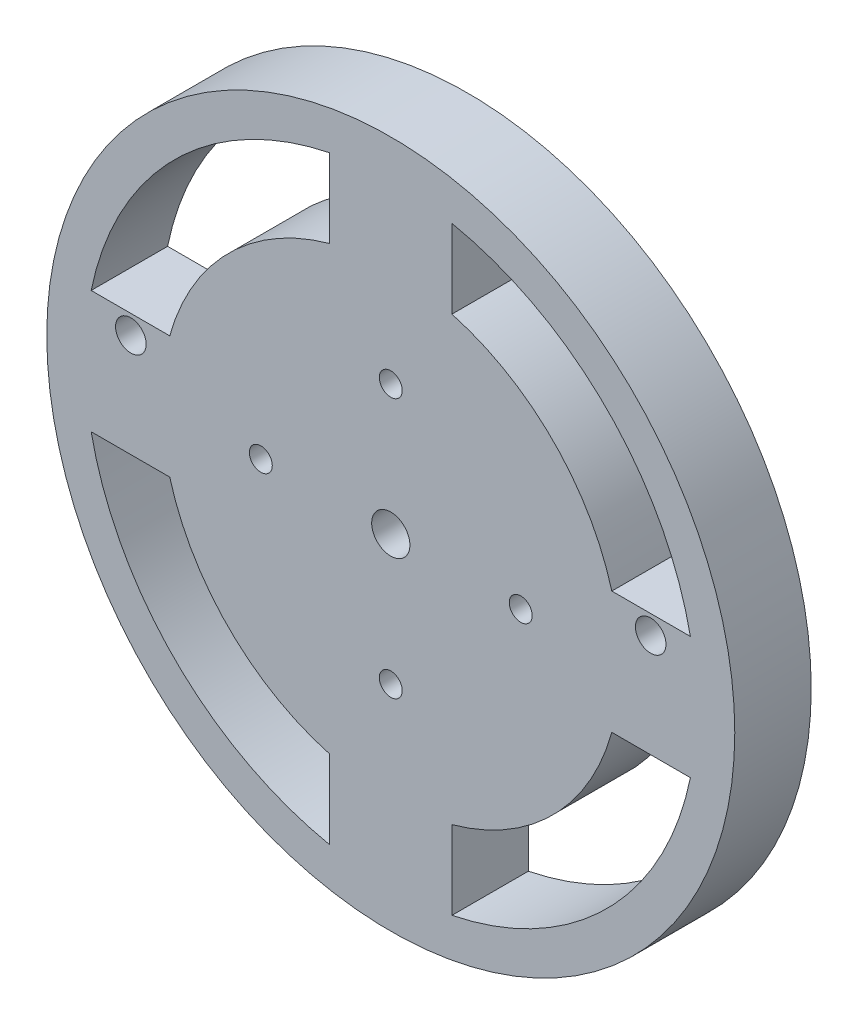
ISO-10303-21;
HEADER;
FILE_DESCRIPTION(('STEP AP214'),'2;1');
FILE_NAME('part.step','',(''),(''),'','','');
FILE_SCHEMA(('AUTOMOTIVE_DESIGN { 1 0 10303 214 1 1 1 1 }'));
ENDSEC;
DATA;
#1=APPLICATION_CONTEXT('core data for automotive mechanical design processes');
#2=APPLICATION_PROTOCOL_DEFINITION('international standard','automotive_design',2000,#1);
#3=PRODUCT_CONTEXT('',#1,'mechanical');
#4=PRODUCT('Part','Part','',(#3));
#5=PRODUCT_RELATED_PRODUCT_CATEGORY('part','',(#4));
#6=PRODUCT_DEFINITION_FORMATION('','',#4);
#7=PRODUCT_DEFINITION_CONTEXT('part definition',#1,'design');
#8=PRODUCT_DEFINITION('design','',#6,#7);
#9=PRODUCT_DEFINITION_SHAPE('','',#8);
#10=(LENGTH_UNIT() NAMED_UNIT(*) SI_UNIT(.MILLI.,.METRE.));
#11=(NAMED_UNIT(*) PLANE_ANGLE_UNIT() SI_UNIT($,.RADIAN.));
#12=(NAMED_UNIT(*) SI_UNIT($,.STERADIAN.) SOLID_ANGLE_UNIT());
#13=UNCERTAINTY_MEASURE_WITH_UNIT(LENGTH_MEASURE(1.E-05),#10,'distance_accuracy_value','');
#14=(GEOMETRIC_REPRESENTATION_CONTEXT(3) GLOBAL_UNCERTAINTY_ASSIGNED_CONTEXT((#13)) GLOBAL_UNIT_ASSIGNED_CONTEXT((#10,
#11,#12)) REPRESENTATION_CONTEXT('',''));
#15=CARTESIAN_POINT('',(0.,0.,0.));
#16=DIRECTION('',(0.,0.,1.));
#17=DIRECTION('',(1.,0.,0.));
#18=AXIS2_PLACEMENT_3D('',#15,#16,#17);
#19=CARTESIAN_POINT('',(0.,0.,10.));
#20=DIRECTION('',(0.,0.,1.));
#21=DIRECTION('',(1.,0.,0.));
#22=AXIS2_PLACEMENT_3D('',#19,#20,#21);
#23=PLANE('',#22);
#24=CARTESIAN_POINT('',(34.,5.5,10.));
#25=DIRECTION('',(0.,0.,1.));
#26=DIRECTION('',(1.,0.,0.));
#27=AXIS2_PLACEMENT_3D('',#24,#25,#26);
#28=CIRCLE('',#27,2.);
#29=CARTESIAN_POINT('',(36.,5.5,10.));
#30=VERTEX_POINT('',#29);
#31=EDGE_CURVE('E334',#30,#30,#28,.T.);
#32=ORIENTED_EDGE('',*,*,#31,.F.);
#33=EDGE_LOOP('',(#32));
#34=FACE_BOUND('',#33,.T.);
#35=CARTESIAN_POINT('',(-34.,5.5,10.));
#36=DIRECTION('',(0.,0.,1.));
#37=DIRECTION('',(1.,0.,0.));
#38=AXIS2_PLACEMENT_3D('',#35,#36,#37);
#39=CIRCLE('',#38,2.);
#40=CARTESIAN_POINT('',(-32.,5.5,10.));
#41=VERTEX_POINT('',#40);
#42=EDGE_CURVE('E338',#41,#41,#39,.T.);
#43=ORIENTED_EDGE('',*,*,#42,.F.);
#44=EDGE_LOOP('',(#43));
#45=FACE_BOUND('',#44,.T.);
#46=CARTESIAN_POINT('',(0.,-17.,10.));
#47=DIRECTION('',(0.,0.,1.));
#48=DIRECTION('',(1.,0.,0.));
#49=AXIS2_PLACEMENT_3D('',#46,#47,#48);
#50=CIRCLE('',#49,1.5);
#51=CARTESIAN_POINT('',(1.50000000000001,-17.,10.));
#52=VERTEX_POINT('',#51);
#53=EDGE_CURVE('E283',#52,#52,#50,.T.);
#54=ORIENTED_EDGE('',*,*,#53,.F.);
#55=EDGE_LOOP('',(#54));
#56=FACE_BOUND('',#55,.T.);
#57=CARTESIAN_POINT('',(0.,17.,10.));
#58=DIRECTION('',(0.,0.,1.));
#59=DIRECTION('',(1.,0.,0.));
#60=AXIS2_PLACEMENT_3D('',#57,#58,#59);
#61=CIRCLE('',#60,1.5);
#62=CARTESIAN_POINT('',(1.50000000000001,17.,10.));
#63=VERTEX_POINT('',#62);
#64=EDGE_CURVE('E295',#63,#63,#61,.T.);
#65=ORIENTED_EDGE('',*,*,#64,.F.);
#66=EDGE_LOOP('',(#65));
#67=FACE_BOUND('',#66,.T.);
#68=CARTESIAN_POINT('',(0.,0.,10.));
#69=DIRECTION('',(0.,0.,1.));
#70=DIRECTION('',(1.,0.,0.));
#71=AXIS2_PLACEMENT_3D('',#68,#69,#70);
#72=CIRCLE('',#71,45.);
#73=CARTESIAN_POINT('',(45.,0.,10.));
#74=VERTEX_POINT('',#73);
#75=EDGE_CURVE('E11',#74,#74,#72,.T.);
#76=ORIENTED_EDGE('',*,*,#75,.T.);
#77=EDGE_LOOP('',(#76));
#78=FACE_BOUND('',#77,.T.);
#79=CARTESIAN_POINT('',(0.,0.,10.));
#80=DIRECTION('',(0.,0.,1.));
#81=DIRECTION('',(1.,0.,0.));
#82=AXIS2_PLACEMENT_3D('',#79,#80,#81);
#83=CIRCLE('',#82,2.5);
#84=CARTESIAN_POINT('',(2.5,0.,10.));
#85=VERTEX_POINT('',#84);
#86=EDGE_CURVE('E301',#85,#85,#83,.T.);
#87=ORIENTED_EDGE('',*,*,#86,.F.);
#88=EDGE_LOOP('',(#87));
#89=FACE_BOUND('',#88,.T.);
#90=CARTESIAN_POINT('',(17.,0.,10.));
#91=DIRECTION('',(0.,0.,1.));
#92=DIRECTION('',(1.,0.,0.));
#93=AXIS2_PLACEMENT_3D('',#90,#91,#92);
#94=CIRCLE('',#93,1.5);
#95=CARTESIAN_POINT('',(18.5,0.,10.));
#96=VERTEX_POINT('',#95);
#97=EDGE_CURVE('E289',#96,#96,#94,.T.);
#98=ORIENTED_EDGE('',*,*,#97,.F.);
#99=EDGE_LOOP('',(#98));
#100=FACE_BOUND('',#99,.T.);
#101=CARTESIAN_POINT('',(-17.,0.,10.));
#102=DIRECTION('',(0.,0.,1.));
#103=DIRECTION('',(1.,0.,0.));
#104=AXIS2_PLACEMENT_3D('',#101,#102,#103);
#105=CIRCLE('',#104,1.5);
#106=CARTESIAN_POINT('',(-15.5,0.,10.));
#107=VERTEX_POINT('',#106);
#108=EDGE_CURVE('E277',#107,#107,#105,.T.);
#109=ORIENTED_EDGE('',*,*,#108,.F.);
#110=EDGE_LOOP('',(#109));
#111=FACE_BOUND('',#110,.T.);
#112=DIRECTION('',(1.,0.,0.));
#113=VECTOR('',#112,1.);
#114=CARTESIAN_POINT('',(-39.1918358845309,8.,10.));
#115=LINE('',#114,#113);
#116=CARTESIAN_POINT('',(-39.1918358845309,8.,10.));
#117=VERTEX_POINT('',#116);
#118=CARTESIAN_POINT('',(-28.9136645896019,8.,10.));
#119=VERTEX_POINT('',#118);
#120=EDGE_CURVE('E248',#117,#119,#115,.T.);
#121=ORIENTED_EDGE('',*,*,#120,.F.);
#122=CARTESIAN_POINT('',(0.,0.,10.));
#123=DIRECTION('',(0.,0.,1.));
#124=DIRECTION('',(1.,0.,0.));
#125=AXIS2_PLACEMENT_3D('',#122,#123,#124);
#126=CIRCLE('',#125,40.);
#127=CARTESIAN_POINT('',(-8.,39.1918358845309,10.));
#128=VERTEX_POINT('',#127);
#129=EDGE_CURVE('E246',#128,#117,#126,.T.);
#130=ORIENTED_EDGE('',*,*,#129,.F.);
#131=DIRECTION('',(0.,1.,0.));
#132=VECTOR('',#131,1.);
#133=CARTESIAN_POINT('',(-8.,39.1918358845309,10.));
#134=LINE('',#133,#132);
#135=CARTESIAN_POINT('',(-8.,28.9136645896019,10.));
#136=VERTEX_POINT('',#135);
#137=EDGE_CURVE('E254',#136,#128,#134,.T.);
#138=ORIENTED_EDGE('',*,*,#137,.F.);
#139=CARTESIAN_POINT('',(0.,0.,10.));
#140=DIRECTION('',(0.,0.,-1.));
#141=DIRECTION('',(1.,0.,0.));
#142=AXIS2_PLACEMENT_3D('',#139,#140,#141);
#143=CIRCLE('',#142,30.);
#144=EDGE_CURVE('E251',#119,#136,#143,.T.);
#145=ORIENTED_EDGE('',*,*,#144,.F.);
#146=EDGE_LOOP('',(#121,#130,#138,#145));
#147=FACE_BOUND('',#146,.T.);
#148=DIRECTION('',(1.,0.,0.));
#149=VECTOR('',#148,1.);
#150=CARTESIAN_POINT('',(28.9136645896019,8.,10.));
#151=LINE('',#150,#149);
#152=CARTESIAN_POINT('',(28.9136645896019,8.,10.));
#153=VERTEX_POINT('',#152);
#154=CARTESIAN_POINT('',(39.1918358845309,8.,10.));
#155=VERTEX_POINT('',#154);
#156=EDGE_CURVE('E217',#153,#155,#151,.T.);
#157=ORIENTED_EDGE('',*,*,#156,.F.);
#158=CARTESIAN_POINT('',(0.,0.,10.));
#159=DIRECTION('',(0.,0.,-1.));
#160=DIRECTION('',(1.,0.,0.));
#161=AXIS2_PLACEMENT_3D('',#158,#159,#160);
#162=CIRCLE('',#161,30.);
#163=CARTESIAN_POINT('',(8.,28.9136645896019,10.));
#164=VERTEX_POINT('',#163);
#165=EDGE_CURVE('E215',#164,#153,#162,.T.);
#166=ORIENTED_EDGE('',*,*,#165,.F.);
#167=DIRECTION('',(0.,-1.,0.));
#168=VECTOR('',#167,1.);
#169=CARTESIAN_POINT('',(8.,39.1918358845309,10.));
#170=LINE('',#169,#168);
#171=CARTESIAN_POINT('',(8.,39.1918358845309,10.));
#172=VERTEX_POINT('',#171);
#173=EDGE_CURVE('E223',#172,#164,#170,.T.);
#174=ORIENTED_EDGE('',*,*,#173,.F.);
#175=CARTESIAN_POINT('',(0.,0.,10.));
#176=DIRECTION('',(0.,0.,1.));
#177=DIRECTION('',(1.,0.,0.));
#178=AXIS2_PLACEMENT_3D('',#175,#176,#177);
#179=CIRCLE('',#178,40.);
#180=EDGE_CURVE('E220',#155,#172,#179,.T.);
#181=ORIENTED_EDGE('',*,*,#180,.F.);
#182=EDGE_LOOP('',(#157,#166,#174,#181));
#183=FACE_BOUND('',#182,.T.);
#184=DIRECTION('',(0.,1.,0.));
#185=VECTOR('',#184,1.);
#186=CARTESIAN_POINT('',(-8.,-28.9136645896019,10.));
#187=LINE('',#186,#185);
#188=CARTESIAN_POINT('',(-8.,-39.1918358845308,10.));
#189=VERTEX_POINT('',#188);
#190=CARTESIAN_POINT('',(-8.00000000000001,-28.9136645896019,10.));
#191=VERTEX_POINT('',#190);
#192=EDGE_CURVE('E186',#189,#191,#187,.T.);
#193=ORIENTED_EDGE('',*,*,#192,.F.);
#194=CARTESIAN_POINT('',(0.,0.,10.));
#195=DIRECTION('',(0.,0.,1.));
#196=DIRECTION('',(1.,0.,0.));
#197=AXIS2_PLACEMENT_3D('',#194,#195,#196);
#198=CIRCLE('',#197,40.);
#199=CARTESIAN_POINT('',(-39.1918358845309,-8.,10.));
#200=VERTEX_POINT('',#199);
#201=EDGE_CURVE('E184',#200,#189,#198,.T.);
#202=ORIENTED_EDGE('',*,*,#201,.F.);
#203=DIRECTION('',(-1.,0.,0.));
#204=VECTOR('',#203,1.);
#205=CARTESIAN_POINT('',(-39.1918358845309,-8.,10.));
#206=LINE('',#205,#204);
#207=CARTESIAN_POINT('',(-28.9136645896019,-8.,10.));
#208=VERTEX_POINT('',#207);
#209=EDGE_CURVE('E192',#208,#200,#206,.T.);
#210=ORIENTED_EDGE('',*,*,#209,.F.);
#211=CARTESIAN_POINT('',(0.,0.,10.));
#212=DIRECTION('',(0.,0.,-1.));
#213=DIRECTION('',(1.,0.,0.));
#214=AXIS2_PLACEMENT_3D('',#211,#212,#213);
#215=CIRCLE('',#214,30.);
#216=EDGE_CURVE('E189',#191,#208,#215,.T.);
#217=ORIENTED_EDGE('',*,*,#216,.F.);
#218=EDGE_LOOP('',(#193,#202,#210,#217));
#219=FACE_BOUND('',#218,.T.);
#220=DIRECTION('',(-1.,0.,0.));
#221=VECTOR('',#220,1.);
#222=CARTESIAN_POINT('',(28.9136645896019,-8.,10.));
#223=LINE('',#222,#221);
#224=CARTESIAN_POINT('',(39.1918358845309,-8.,10.));
#225=VERTEX_POINT('',#224);
#226=CARTESIAN_POINT('',(28.9136645896019,-8.00000000000001,10.));
#227=VERTEX_POINT('',#226);
#228=EDGE_CURVE('E154',#225,#227,#223,.T.);
#229=ORIENTED_EDGE('',*,*,#228,.F.);
#230=CARTESIAN_POINT('',(0.,0.,10.));
#231=DIRECTION('',(0.,0.,1.));
#232=DIRECTION('',(1.,0.,0.));
#233=AXIS2_PLACEMENT_3D('',#230,#231,#232);
#234=CIRCLE('',#233,40.);
#235=CARTESIAN_POINT('',(8.,-39.1918358845309,10.));
#236=VERTEX_POINT('',#235);
#237=EDGE_CURVE('E146',#236,#225,#234,.T.);
#238=ORIENTED_EDGE('',*,*,#237,.F.);
#239=DIRECTION('',(0.,-1.,0.));
#240=VECTOR('',#239,1.);
#241=CARTESIAN_POINT('',(8.,-28.9136645896019,10.));
#242=LINE('',#241,#240);
#243=CARTESIAN_POINT('',(8.,-28.9136645896019,10.));
#244=VERTEX_POINT('',#243);
#245=EDGE_CURVE('E168',#244,#236,#242,.T.);
#246=ORIENTED_EDGE('',*,*,#245,.F.);
#247=CARTESIAN_POINT('',(0.,0.,10.));
#248=DIRECTION('',(0.,0.,-1.));
#249=DIRECTION('',(1.,0.,0.));
#250=AXIS2_PLACEMENT_3D('',#247,#248,#249);
#251=CIRCLE('',#250,30.);
#252=EDGE_CURVE('E166',#227,#244,#251,.T.);
#253=ORIENTED_EDGE('',*,*,#252,.F.);
#254=EDGE_LOOP('',(#229,#238,#246,#253));
#255=FACE_BOUND('',#254,.T.);
#256=ADVANCED_FACE('F33',(#34,#45,#56,#67,#78,#89,#100,#111,#147,#183,#219,#255),#23,.T.);
#257=CARTESIAN_POINT('',(0.,0.,0.));
#258=DIRECTION('',(0.,0.,1.));
#259=DIRECTION('',(1.,0.,0.));
#260=AXIS2_PLACEMENT_3D('',#257,#258,#259);
#261=PLANE('',#260);
#262=CARTESIAN_POINT('',(34.,5.5,0.));
#263=DIRECTION('',(0.,0.,1.));
#264=DIRECTION('',(1.,0.,0.));
#265=AXIS2_PLACEMENT_3D('',#262,#263,#264);
#266=CIRCLE('',#265,2.);
#267=CARTESIAN_POINT('',(36.,5.5,0.));
#268=VERTEX_POINT('',#267);
#269=EDGE_CURVE('E494',#268,#268,#266,.T.);
#270=ORIENTED_EDGE('',*,*,#269,.T.);
#271=EDGE_LOOP('',(#270));
#272=FACE_BOUND('',#271,.T.);
#273=CARTESIAN_POINT('',(-34.,5.5,0.));
#274=DIRECTION('',(0.,0.,1.));
#275=DIRECTION('',(1.,0.,0.));
#276=AXIS2_PLACEMENT_3D('',#273,#274,#275);
#277=CIRCLE('',#276,2.);
#278=CARTESIAN_POINT('',(-32.,5.5,0.));
#279=VERTEX_POINT('',#278);
#280=EDGE_CURVE('E174',#279,#279,#277,.T.);
#281=ORIENTED_EDGE('',*,*,#280,.T.);
#282=EDGE_LOOP('',(#281));
#283=FACE_BOUND('',#282,.T.);
#284=CARTESIAN_POINT('',(0.,0.,0.));
#285=DIRECTION('',(0.,0.,1.));
#286=DIRECTION('',(1.,0.,0.));
#287=AXIS2_PLACEMENT_3D('',#284,#285,#286);
#288=CIRCLE('',#287,40.);
#289=CARTESIAN_POINT('',(-39.1918358845309,-8.,0.));
#290=VERTEX_POINT('',#289);
#291=CARTESIAN_POINT('',(-8.,-39.1918358845308,0.));
#292=VERTEX_POINT('',#291);
#293=EDGE_CURVE('E162',#290,#292,#288,.T.);
#294=ORIENTED_EDGE('',*,*,#293,.T.);
#295=DIRECTION('',(0.,1.,0.));
#296=VECTOR('',#295,1.);
#297=CARTESIAN_POINT('',(-8.,-28.9136645896019,0.));
#298=LINE('',#297,#296);
#299=CARTESIAN_POINT('',(-8.00000000000001,-28.9136645896019,0.));
#300=VERTEX_POINT('',#299);
#301=EDGE_CURVE('E197',#292,#300,#298,.T.);
#302=ORIENTED_EDGE('',*,*,#301,.T.);
#303=CARTESIAN_POINT('',(0.,0.,0.));
#304=DIRECTION('',(0.,0.,-1.));
#305=DIRECTION('',(1.,0.,0.));
#306=AXIS2_PLACEMENT_3D('',#303,#304,#305);
#307=CIRCLE('',#306,30.);
#308=CARTESIAN_POINT('',(-28.9136645896019,-8.,0.));
#309=VERTEX_POINT('',#308);
#310=EDGE_CURVE('E200',#300,#309,#307,.T.);
#311=ORIENTED_EDGE('',*,*,#310,.T.);
#312=DIRECTION('',(-1.,0.,0.));
#313=VECTOR('',#312,1.);
#314=CARTESIAN_POINT('',(-39.1918358845309,-8.,0.));
#315=LINE('',#314,#313);
#316=EDGE_CURVE('E187',#309,#290,#315,.T.);
#317=ORIENTED_EDGE('',*,*,#316,.T.);
#318=EDGE_LOOP('',(#294,#302,#311,#317));
#319=FACE_BOUND('',#318,.T.);
#320=CARTESIAN_POINT('',(0.,0.,0.));
#321=DIRECTION('',(0.,0.,1.));
#322=DIRECTION('',(1.,0.,0.));
#323=AXIS2_PLACEMENT_3D('',#320,#321,#322);
#324=CIRCLE('',#323,40.);
#325=CARTESIAN_POINT('',(-8.,39.1918358845309,0.));
#326=VERTEX_POINT('',#325);
#327=CARTESIAN_POINT('',(-39.1918358845309,8.,0.));
#328=VERTEX_POINT('',#327);
#329=EDGE_CURVE('E245',#326,#328,#324,.T.);
#330=ORIENTED_EDGE('',*,*,#329,.T.);
#331=DIRECTION('',(1.,0.,0.));
#332=VECTOR('',#331,1.);
#333=CARTESIAN_POINT('',(-39.1918358845309,8.,0.));
#334=LINE('',#333,#332);
#335=CARTESIAN_POINT('',(-28.9136645896019,8.,0.));
#336=VERTEX_POINT('',#335);
#337=EDGE_CURVE('E259',#328,#336,#334,.T.);
#338=ORIENTED_EDGE('',*,*,#337,.T.);
#339=CARTESIAN_POINT('',(0.,0.,0.));
#340=DIRECTION('',(0.,0.,-1.));
#341=DIRECTION('',(1.,0.,0.));
#342=AXIS2_PLACEMENT_3D('',#339,#340,#341);
#343=CIRCLE('',#342,30.);
#344=CARTESIAN_POINT('',(-8.,28.9136645896019,0.));
#345=VERTEX_POINT('',#344);
#346=EDGE_CURVE('E262',#336,#345,#343,.T.);
#347=ORIENTED_EDGE('',*,*,#346,.T.);
#348=DIRECTION('',(0.,1.,0.));
#349=VECTOR('',#348,1.);
#350=CARTESIAN_POINT('',(-8.,39.1918358845309,0.));
#351=LINE('',#350,#349);
#352=EDGE_CURVE('E249',#345,#326,#351,.T.);
#353=ORIENTED_EDGE('',*,*,#352,.T.);
#354=EDGE_LOOP('',(#330,#338,#347,#353));
#355=FACE_BOUND('',#354,.T.);
#356=CARTESIAN_POINT('',(0.,0.,0.));
#357=DIRECTION('',(0.,0.,1.));
#358=DIRECTION('',(1.,0.,0.));
#359=AXIS2_PLACEMENT_3D('',#356,#357,#358);
#360=CIRCLE('',#359,45.);
#361=CARTESIAN_POINT('',(45.,0.,0.));
#362=VERTEX_POINT('',#361);
#363=EDGE_CURVE('E37',#362,#362,#360,.T.);
#364=ORIENTED_EDGE('',*,*,#363,.F.);
#365=EDGE_LOOP('',(#364));
#366=FACE_BOUND('',#365,.T.);
#367=CARTESIAN_POINT('',(0.,0.,0.));
#368=DIRECTION('',(0.,0.,1.));
#369=DIRECTION('',(1.,0.,0.));
#370=AXIS2_PLACEMENT_3D('',#367,#368,#369);
#371=CIRCLE('',#370,2.5);
#372=CARTESIAN_POINT('',(2.5,0.,0.));
#373=VERTEX_POINT('',#372);
#374=EDGE_CURVE('E298',#373,#373,#371,.T.);
#375=ORIENTED_EDGE('',*,*,#374,.T.);
#376=EDGE_LOOP('',(#375));
#377=FACE_BOUND('',#376,.T.);
#378=CARTESIAN_POINT('',(0.,17.,0.));
#379=DIRECTION('',(0.,0.,1.));
#380=DIRECTION('',(1.,0.,0.));
#381=AXIS2_PLACEMENT_3D('',#378,#379,#380);
#382=CIRCLE('',#381,1.5);
#383=CARTESIAN_POINT('',(1.50000000000001,17.,0.));
#384=VERTEX_POINT('',#383);
#385=EDGE_CURVE('E292',#384,#384,#382,.T.);
#386=ORIENTED_EDGE('',*,*,#385,.T.);
#387=EDGE_LOOP('',(#386));
#388=FACE_BOUND('',#387,.T.);
#389=CARTESIAN_POINT('',(17.,0.,0.));
#390=DIRECTION('',(0.,0.,1.));
#391=DIRECTION('',(1.,0.,0.));
#392=AXIS2_PLACEMENT_3D('',#389,#390,#391);
#393=CIRCLE('',#392,1.5);
#394=CARTESIAN_POINT('',(18.5,0.,0.));
#395=VERTEX_POINT('',#394);
#396=EDGE_CURVE('E286',#395,#395,#393,.T.);
#397=ORIENTED_EDGE('',*,*,#396,.T.);
#398=EDGE_LOOP('',(#397));
#399=FACE_BOUND('',#398,.T.);
#400=CARTESIAN_POINT('',(0.,-17.,0.));
#401=DIRECTION('',(0.,0.,1.));
#402=DIRECTION('',(1.,0.,0.));
#403=AXIS2_PLACEMENT_3D('',#400,#401,#402);
#404=CIRCLE('',#403,1.5);
#405=CARTESIAN_POINT('',(1.50000000000001,-17.,0.));
#406=VERTEX_POINT('',#405);
#407=EDGE_CURVE('E280',#406,#406,#404,.T.);
#408=ORIENTED_EDGE('',*,*,#407,.T.);
#409=EDGE_LOOP('',(#408));
#410=FACE_BOUND('',#409,.T.);
#411=CARTESIAN_POINT('',(-17.,0.,0.));
#412=DIRECTION('',(0.,0.,1.));
#413=DIRECTION('',(1.,0.,0.));
#414=AXIS2_PLACEMENT_3D('',#411,#412,#413);
#415=CIRCLE('',#414,1.5);
#416=CARTESIAN_POINT('',(-15.5,0.,0.));
#417=VERTEX_POINT('',#416);
#418=EDGE_CURVE('E276',#417,#417,#415,.T.);
#419=ORIENTED_EDGE('',*,*,#418,.T.);
#420=EDGE_LOOP('',(#419));
#421=FACE_BOUND('',#420,.T.);
#422=CARTESIAN_POINT('',(0.,0.,0.));
#423=DIRECTION('',(0.,0.,-1.));
#424=DIRECTION('',(1.,0.,0.));
#425=AXIS2_PLACEMENT_3D('',#422,#423,#424);
#426=CIRCLE('',#425,30.);
#427=CARTESIAN_POINT('',(8.,28.9136645896019,0.));
#428=VERTEX_POINT('',#427);
#429=CARTESIAN_POINT('',(28.9136645896019,8.,0.));
#430=VERTEX_POINT('',#429);
#431=EDGE_CURVE('E214',#428,#430,#426,.T.);
#432=ORIENTED_EDGE('',*,*,#431,.T.);
#433=DIRECTION('',(1.,0.,0.));
#434=VECTOR('',#433,1.);
#435=CARTESIAN_POINT('',(28.9136645896019,8.,0.));
#436=LINE('',#435,#434);
#437=CARTESIAN_POINT('',(39.1918358845309,8.,0.));
#438=VERTEX_POINT('',#437);
#439=EDGE_CURVE('E228',#430,#438,#436,.T.);
#440=ORIENTED_EDGE('',*,*,#439,.T.);
#441=CARTESIAN_POINT('',(0.,0.,0.));
#442=DIRECTION('',(0.,0.,1.));
#443=DIRECTION('',(1.,0.,0.));
#444=AXIS2_PLACEMENT_3D('',#441,#442,#443);
#445=CIRCLE('',#444,40.);
#446=CARTESIAN_POINT('',(8.,39.1918358845309,0.));
#447=VERTEX_POINT('',#446);
#448=EDGE_CURVE('E231',#438,#447,#445,.T.);
#449=ORIENTED_EDGE('',*,*,#448,.T.);
#450=DIRECTION('',(0.,-1.,0.));
#451=VECTOR('',#450,1.);
#452=CARTESIAN_POINT('',(8.,39.1918358845309,0.));
#453=LINE('',#452,#451);
#454=EDGE_CURVE('E218',#447,#428,#453,.T.);
#455=ORIENTED_EDGE('',*,*,#454,.T.);
#456=EDGE_LOOP('',(#432,#440,#449,#455));
#457=FACE_BOUND('',#456,.T.);
#458=CARTESIAN_POINT('',(0.,0.,0.));
#459=DIRECTION('',(0.,0.,1.));
#460=DIRECTION('',(1.,0.,0.));
#461=AXIS2_PLACEMENT_3D('',#458,#459,#460);
#462=CIRCLE('',#461,40.);
#463=CARTESIAN_POINT('',(8.,-39.1918358845309,0.));
#464=VERTEX_POINT('',#463);
#465=CARTESIAN_POINT('',(39.1918358845309,-8.,0.));
#466=VERTEX_POINT('',#465);
#467=EDGE_CURVE('E56',#464,#466,#462,.T.);
#468=ORIENTED_EDGE('',*,*,#467,.T.);
#469=DIRECTION('',(-1.,0.,0.));
#470=VECTOR('',#469,1.);
#471=CARTESIAN_POINT('',(28.9136645896019,-8.,0.));
#472=LINE('',#471,#470);
#473=CARTESIAN_POINT('',(28.9136645896019,-8.00000000000001,0.));
#474=VERTEX_POINT('',#473);
#475=EDGE_CURVE('E161',#466,#474,#472,.T.);
#476=ORIENTED_EDGE('',*,*,#475,.T.);
#477=CARTESIAN_POINT('',(0.,0.,0.));
#478=DIRECTION('',(0.,0.,-1.));
#479=DIRECTION('',(1.,0.,0.));
#480=AXIS2_PLACEMENT_3D('',#477,#478,#479);
#481=CIRCLE('',#480,30.);
#482=CARTESIAN_POINT('',(8.,-28.9136645896019,0.));
#483=VERTEX_POINT('',#482);
#484=EDGE_CURVE('E176',#474,#483,#481,.T.);
#485=ORIENTED_EDGE('',*,*,#484,.T.);
#486=DIRECTION('',(0.,-1.,0.));
#487=VECTOR('',#486,1.);
#488=CARTESIAN_POINT('',(8.,-28.9136645896019,0.));
#489=LINE('',#488,#487);
#490=EDGE_CURVE('E155',#483,#464,#489,.T.);
#491=ORIENTED_EDGE('',*,*,#490,.T.);
#492=EDGE_LOOP('',(#468,#476,#485,#491));
#493=FACE_BOUND('',#492,.T.);
#494=ADVANCED_FACE('F307',(#272,#283,#319,#355,#366,#377,#388,#399,#410,#421,#457,#493),#261,.F.);
#495=CARTESIAN_POINT('',(0.,0.,10.));
#496=DIRECTION('',(0.,0.,-1.));
#497=DIRECTION('',(-1.,0.,0.));
#498=AXIS2_PLACEMENT_3D('',#495,#496,#497);
#499=CYLINDRICAL_SURFACE('',#498,45.);
#500=ORIENTED_EDGE('',*,*,#75,.F.);
#501=EDGE_LOOP('',(#500));
#502=FACE_BOUND('',#501,.T.);
#503=ORIENTED_EDGE('',*,*,#363,.T.);
#504=EDGE_LOOP('',(#503));
#505=FACE_BOUND('',#504,.T.);
#506=ADVANCED_FACE('F35',(#502,#505),#499,.T.);
#507=CARTESIAN_POINT('',(0.,0.,10.));
#508=DIRECTION('',(0.,0.,-1.));
#509=DIRECTION('',(-1.,0.,0.));
#510=AXIS2_PLACEMENT_3D('',#507,#508,#509);
#511=CYLINDRICAL_SURFACE('',#510,2.5);
#512=ORIENTED_EDGE('',*,*,#86,.T.);
#513=EDGE_LOOP('',(#512));
#514=FACE_BOUND('',#513,.T.);
#515=ORIENTED_EDGE('',*,*,#374,.F.);
#516=EDGE_LOOP('',(#515));
#517=FACE_BOUND('',#516,.T.);
#518=ADVANCED_FACE('F310',(#514,#517),#511,.F.);
#519=CARTESIAN_POINT('',(0.,17.,10.));
#520=DIRECTION('',(0.,0.,-1.));
#521=DIRECTION('',(-1.,0.,0.));
#522=AXIS2_PLACEMENT_3D('',#519,#520,#521);
#523=CYLINDRICAL_SURFACE('',#522,1.5);
#524=ORIENTED_EDGE('',*,*,#64,.T.);
#525=EDGE_LOOP('',(#524));
#526=FACE_BOUND('',#525,.T.);
#527=ORIENTED_EDGE('',*,*,#385,.F.);
#528=EDGE_LOOP('',(#527));
#529=FACE_BOUND('',#528,.T.);
#530=ADVANCED_FACE('F312',(#526,#529),#523,.F.);
#531=CARTESIAN_POINT('',(17.,0.,10.));
#532=DIRECTION('',(0.,0.,-1.));
#533=DIRECTION('',(-1.,0.,0.));
#534=AXIS2_PLACEMENT_3D('',#531,#532,#533);
#535=CYLINDRICAL_SURFACE('',#534,1.5);
#536=ORIENTED_EDGE('',*,*,#97,.T.);
#537=EDGE_LOOP('',(#536));
#538=FACE_BOUND('',#537,.T.);
#539=ORIENTED_EDGE('',*,*,#396,.F.);
#540=EDGE_LOOP('',(#539));
#541=FACE_BOUND('',#540,.T.);
#542=ADVANCED_FACE('F319',(#538,#541),#535,.F.);
#543=CARTESIAN_POINT('',(0.,-17.,10.));
#544=DIRECTION('',(0.,0.,-1.));
#545=DIRECTION('',(-1.,0.,0.));
#546=AXIS2_PLACEMENT_3D('',#543,#544,#545);
#547=CYLINDRICAL_SURFACE('',#546,1.5);
#548=ORIENTED_EDGE('',*,*,#53,.T.);
#549=EDGE_LOOP('',(#548));
#550=FACE_BOUND('',#549,.T.);
#551=ORIENTED_EDGE('',*,*,#407,.F.);
#552=EDGE_LOOP('',(#551));
#553=FACE_BOUND('',#552,.T.);
#554=ADVANCED_FACE('F427',(#550,#553),#547,.F.);
#555=CARTESIAN_POINT('',(-17.,0.,10.));
#556=DIRECTION('',(0.,0.,-1.));
#557=DIRECTION('',(-1.,0.,0.));
#558=AXIS2_PLACEMENT_3D('',#555,#556,#557);
#559=CYLINDRICAL_SURFACE('',#558,1.5);
#560=ORIENTED_EDGE('',*,*,#108,.T.);
#561=EDGE_LOOP('',(#560));
#562=FACE_BOUND('',#561,.T.);
#563=ORIENTED_EDGE('',*,*,#418,.F.);
#564=EDGE_LOOP('',(#563));
#565=FACE_BOUND('',#564,.T.);
#566=ADVANCED_FACE('F423',(#562,#565),#559,.F.);
#567=CARTESIAN_POINT('',(0.,0.,10.));
#568=DIRECTION('',(0.,0.,-1.));
#569=DIRECTION('',(-1.,0.,0.));
#570=AXIS2_PLACEMENT_3D('',#567,#568,#569);
#571=CYLINDRICAL_SURFACE('',#570,40.);
#572=ORIENTED_EDGE('',*,*,#329,.F.);
#573=DIRECTION('',(0.,0.,-1.));
#574=VECTOR('',#573,1.);
#575=CARTESIAN_POINT('',(-8.,39.1918358845309,10.));
#576=LINE('',#575,#574);
#577=EDGE_CURVE('E256',#128,#326,#576,.T.);
#578=ORIENTED_EDGE('',*,*,#577,.F.);
#579=ORIENTED_EDGE('',*,*,#129,.T.);
#580=DIRECTION('',(0.,0.,-1.));
#581=VECTOR('',#580,1.);
#582=CARTESIAN_POINT('',(-39.1918358845309,8.,10.));
#583=LINE('',#582,#581);
#584=EDGE_CURVE('E273',#117,#328,#583,.T.);
#585=ORIENTED_EDGE('',*,*,#584,.T.);
#586=EDGE_LOOP('',(#572,#578,#579,#585));
#587=FACE_BOUND('',#586,.T.);
#588=ADVANCED_FACE('F419',(#587),#571,.F.);
#589=CARTESIAN_POINT('',(-39.1918358845309,8.,10.));
#590=DIRECTION('',(0.,1.,0.));
#591=DIRECTION('',(0.,0.,1.));
#592=AXIS2_PLACEMENT_3D('',#589,#590,#591);
#593=PLANE('',#592);
#594=ORIENTED_EDGE('',*,*,#337,.F.);
#595=ORIENTED_EDGE('',*,*,#584,.F.);
#596=ORIENTED_EDGE('',*,*,#120,.T.);
#597=DIRECTION('',(0.,0.,-1.));
#598=VECTOR('',#597,1.);
#599=CARTESIAN_POINT('',(-28.9136645896019,8.,10.));
#600=LINE('',#599,#598);
#601=EDGE_CURVE('E271',#119,#336,#600,.T.);
#602=ORIENTED_EDGE('',*,*,#601,.T.);
#603=EDGE_LOOP('',(#594,#595,#596,#602));
#604=FACE_BOUND('',#603,.T.);
#605=ADVANCED_FACE('F415',(#604),#593,.T.);
#606=CARTESIAN_POINT('',(0.,0.,10.));
#607=DIRECTION('',(0.,0.,-1.));
#608=DIRECTION('',(-1.,0.,0.));
#609=AXIS2_PLACEMENT_3D('',#606,#607,#608);
#610=CYLINDRICAL_SURFACE('',#609,30.);
#611=ORIENTED_EDGE('',*,*,#346,.F.);
#612=ORIENTED_EDGE('',*,*,#601,.F.);
#613=ORIENTED_EDGE('',*,*,#144,.T.);
#614=DIRECTION('',(0.,0.,-1.));
#615=VECTOR('',#614,1.);
#616=CARTESIAN_POINT('',(-8.,28.9136645896019,10.));
#617=LINE('',#616,#615);
#618=EDGE_CURVE('E269',#136,#345,#617,.T.);
#619=ORIENTED_EDGE('',*,*,#618,.T.);
#620=EDGE_LOOP('',(#611,#612,#613,#619));
#621=FACE_BOUND('',#620,.T.);
#622=ADVANCED_FACE('F411',(#621),#610,.T.);
#623=CARTESIAN_POINT('',(-8.,39.1918358845309,10.));
#624=DIRECTION('',(-1.,0.,0.));
#625=DIRECTION('',(0.,0.,1.));
#626=AXIS2_PLACEMENT_3D('',#623,#624,#625);
#627=PLANE('',#626);
#628=ORIENTED_EDGE('',*,*,#352,.F.);
#629=ORIENTED_EDGE('',*,*,#618,.F.);
#630=ORIENTED_EDGE('',*,*,#137,.T.);
#631=ORIENTED_EDGE('',*,*,#577,.T.);
#632=EDGE_LOOP('',(#628,#629,#630,#631));
#633=FACE_BOUND('',#632,.T.);
#634=ADVANCED_FACE('F407',(#633),#627,.T.);
#635=CARTESIAN_POINT('',(0.,0.,10.));
#636=DIRECTION('',(0.,0.,-1.));
#637=DIRECTION('',(-1.,0.,0.));
#638=AXIS2_PLACEMENT_3D('',#635,#636,#637);
#639=CYLINDRICAL_SURFACE('',#638,30.);
#640=ORIENTED_EDGE('',*,*,#431,.F.);
#641=DIRECTION('',(0.,0.,-1.));
#642=VECTOR('',#641,1.);
#643=CARTESIAN_POINT('',(8.,28.9136645896019,10.));
#644=LINE('',#643,#642);
#645=EDGE_CURVE('E225',#164,#428,#644,.T.);
#646=ORIENTED_EDGE('',*,*,#645,.F.);
#647=ORIENTED_EDGE('',*,*,#165,.T.);
#648=DIRECTION('',(0.,0.,-1.));
#649=VECTOR('',#648,1.);
#650=CARTESIAN_POINT('',(28.9136645896019,8.,10.));
#651=LINE('',#650,#649);
#652=EDGE_CURVE('E242',#153,#430,#651,.T.);
#653=ORIENTED_EDGE('',*,*,#652,.T.);
#654=EDGE_LOOP('',(#640,#646,#647,#653));
#655=FACE_BOUND('',#654,.T.);
#656=ADVANCED_FACE('F403',(#655),#639,.T.);
#657=CARTESIAN_POINT('',(28.9136645896019,8.,10.));
#658=DIRECTION('',(0.,1.,0.));
#659=DIRECTION('',(0.,0.,1.));
#660=AXIS2_PLACEMENT_3D('',#657,#658,#659);
#661=PLANE('',#660);
#662=ORIENTED_EDGE('',*,*,#439,.F.);
#663=ORIENTED_EDGE('',*,*,#652,.F.);
#664=ORIENTED_EDGE('',*,*,#156,.T.);
#665=DIRECTION('',(0.,0.,-1.));
#666=VECTOR('',#665,1.);
#667=CARTESIAN_POINT('',(39.1918358845309,8.,10.));
#668=LINE('',#667,#666);
#669=EDGE_CURVE('E240',#155,#438,#668,.T.);
#670=ORIENTED_EDGE('',*,*,#669,.T.);
#671=EDGE_LOOP('',(#662,#663,#664,#670));
#672=FACE_BOUND('',#671,.T.);
#673=ADVANCED_FACE('F399',(#672),#661,.T.);
#674=CARTESIAN_POINT('',(0.,0.,10.));
#675=DIRECTION('',(0.,0.,-1.));
#676=DIRECTION('',(-1.,0.,0.));
#677=AXIS2_PLACEMENT_3D('',#674,#675,#676);
#678=CYLINDRICAL_SURFACE('',#677,40.);
#679=ORIENTED_EDGE('',*,*,#448,.F.);
#680=ORIENTED_EDGE('',*,*,#669,.F.);
#681=ORIENTED_EDGE('',*,*,#180,.T.);
#682=DIRECTION('',(0.,0.,-1.));
#683=VECTOR('',#682,1.);
#684=CARTESIAN_POINT('',(8.,39.1918358845309,10.));
#685=LINE('',#684,#683);
#686=EDGE_CURVE('E238',#172,#447,#685,.T.);
#687=ORIENTED_EDGE('',*,*,#686,.T.);
#688=EDGE_LOOP('',(#679,#680,#681,#687));
#689=FACE_BOUND('',#688,.T.);
#690=ADVANCED_FACE('F395',(#689),#678,.F.);
#691=CARTESIAN_POINT('',(8.,39.1918358845309,10.));
#692=DIRECTION('',(1.,0.,0.));
#693=DIRECTION('',(0.,0.,-1.));
#694=AXIS2_PLACEMENT_3D('',#691,#692,#693);
#695=PLANE('',#694);
#696=ORIENTED_EDGE('',*,*,#454,.F.);
#697=ORIENTED_EDGE('',*,*,#686,.F.);
#698=ORIENTED_EDGE('',*,*,#173,.T.);
#699=ORIENTED_EDGE('',*,*,#645,.T.);
#700=EDGE_LOOP('',(#696,#697,#698,#699));
#701=FACE_BOUND('',#700,.T.);
#702=ADVANCED_FACE('F392',(#701),#695,.T.);
#703=CARTESIAN_POINT('',(0.,0.,10.));
#704=DIRECTION('',(0.,0.,-1.));
#705=DIRECTION('',(-1.,0.,0.));
#706=AXIS2_PLACEMENT_3D('',#703,#704,#705);
#707=CYLINDRICAL_SURFACE('',#706,40.);
#708=ORIENTED_EDGE('',*,*,#293,.F.);
#709=DIRECTION('',(0.,0.,-1.));
#710=VECTOR('',#709,1.);
#711=CARTESIAN_POINT('',(-39.1918358845309,-8.,10.));
#712=LINE('',#711,#710);
#713=EDGE_CURVE('E194',#200,#290,#712,.T.);
#714=ORIENTED_EDGE('',*,*,#713,.F.);
#715=ORIENTED_EDGE('',*,*,#201,.T.);
#716=DIRECTION('',(0.,0.,-1.));
#717=VECTOR('',#716,1.);
#718=CARTESIAN_POINT('',(-8.,-39.1918358845308,10.));
#719=LINE('',#718,#717);
#720=EDGE_CURVE('E211',#189,#292,#719,.T.);
#721=ORIENTED_EDGE('',*,*,#720,.T.);
#722=EDGE_LOOP('',(#708,#714,#715,#721));
#723=FACE_BOUND('',#722,.T.);
#724=ADVANCED_FACE('F374',(#723),#707,.F.);
#725=CARTESIAN_POINT('',(-8.,-28.9136645896019,10.));
#726=DIRECTION('',(-1.,0.,0.));
#727=DIRECTION('',(0.,-1.,0.));
#728=AXIS2_PLACEMENT_3D('',#725,#726,#727);
#729=PLANE('',#728);
#730=ORIENTED_EDGE('',*,*,#301,.F.);
#731=ORIENTED_EDGE('',*,*,#720,.F.);
#732=ORIENTED_EDGE('',*,*,#192,.T.);
#733=DIRECTION('',(0.,0.,-1.));
#734=VECTOR('',#733,1.);
#735=CARTESIAN_POINT('',(-8.00000000000001,-28.9136645896019,10.));
#736=LINE('',#735,#734);
#737=EDGE_CURVE('E209',#191,#300,#736,.T.);
#738=ORIENTED_EDGE('',*,*,#737,.T.);
#739=EDGE_LOOP('',(#730,#731,#732,#738));
#740=FACE_BOUND('',#739,.T.);
#741=ADVANCED_FACE('F366',(#740),#729,.T.);
#742=CARTESIAN_POINT('',(0.,0.,10.));
#743=DIRECTION('',(0.,0.,-1.));
#744=DIRECTION('',(-1.,0.,0.));
#745=AXIS2_PLACEMENT_3D('',#742,#743,#744);
#746=CYLINDRICAL_SURFACE('',#745,30.);
#747=ORIENTED_EDGE('',*,*,#310,.F.);
#748=ORIENTED_EDGE('',*,*,#737,.F.);
#749=ORIENTED_EDGE('',*,*,#216,.T.);
#750=DIRECTION('',(0.,0.,-1.));
#751=VECTOR('',#750,1.);
#752=CARTESIAN_POINT('',(-28.9136645896019,-8.,10.));
#753=LINE('',#752,#751);
#754=EDGE_CURVE('E207',#208,#309,#753,.T.);
#755=ORIENTED_EDGE('',*,*,#754,.T.);
#756=EDGE_LOOP('',(#747,#748,#749,#755));
#757=FACE_BOUND('',#756,.T.);
#758=ADVANCED_FACE('F369',(#757),#746,.T.);
#759=CARTESIAN_POINT('',(-39.1918358845309,-8.,10.));
#760=DIRECTION('',(0.,-1.,0.));
#761=DIRECTION('',(0.,0.,-1.));
#762=AXIS2_PLACEMENT_3D('',#759,#760,#761);
#763=PLANE('',#762);
#764=ORIENTED_EDGE('',*,*,#316,.F.);
#765=ORIENTED_EDGE('',*,*,#754,.F.);
#766=ORIENTED_EDGE('',*,*,#209,.T.);
#767=ORIENTED_EDGE('',*,*,#713,.T.);
#768=EDGE_LOOP('',(#764,#765,#766,#767));
#769=FACE_BOUND('',#768,.T.);
#770=ADVANCED_FACE('F377',(#769),#763,.T.);
#771=CARTESIAN_POINT('',(0.,0.,10.));
#772=DIRECTION('',(0.,0.,-1.));
#773=DIRECTION('',(-1.,0.,0.));
#774=AXIS2_PLACEMENT_3D('',#771,#772,#773);
#775=CYLINDRICAL_SURFACE('',#774,40.);
#776=ORIENTED_EDGE('',*,*,#467,.F.);
#777=DIRECTION('',(0.,0.,-1.));
#778=VECTOR('',#777,1.);
#779=CARTESIAN_POINT('',(8.,-39.1918358845309,10.));
#780=LINE('',#779,#778);
#781=EDGE_CURVE('E150',#236,#464,#780,.T.);
#782=ORIENTED_EDGE('',*,*,#781,.F.);
#783=ORIENTED_EDGE('',*,*,#237,.T.);
#784=DIRECTION('',(0.,0.,-1.));
#785=VECTOR('',#784,1.);
#786=CARTESIAN_POINT('',(39.1918358845309,-8.,10.));
#787=LINE('',#786,#785);
#788=EDGE_CURVE('E149',#225,#466,#787,.T.);
#789=ORIENTED_EDGE('',*,*,#788,.T.);
#790=EDGE_LOOP('',(#776,#782,#783,#789));
#791=FACE_BOUND('',#790,.T.);
#792=ADVANCED_FACE('F148',(#791),#775,.F.);
#793=CARTESIAN_POINT('',(28.9136645896019,-8.,10.));
#794=DIRECTION('',(0.,-1.,0.));
#795=DIRECTION('',(0.,0.,-1.));
#796=AXIS2_PLACEMENT_3D('',#793,#794,#795);
#797=PLANE('',#796);
#798=ORIENTED_EDGE('',*,*,#475,.F.);
#799=ORIENTED_EDGE('',*,*,#788,.F.);
#800=ORIENTED_EDGE('',*,*,#228,.T.);
#801=DIRECTION('',(0.,0.,-1.));
#802=VECTOR('',#801,1.);
#803=CARTESIAN_POINT('',(28.9136645896019,-8.00000000000001,10.));
#804=LINE('',#803,#802);
#805=EDGE_CURVE('E163',#227,#474,#804,.T.);
#806=ORIENTED_EDGE('',*,*,#805,.T.);
#807=EDGE_LOOP('',(#798,#799,#800,#806));
#808=FACE_BOUND('',#807,.T.);
#809=ADVANCED_FACE('F158',(#808),#797,.T.);
#810=CARTESIAN_POINT('',(0.,0.,10.));
#811=DIRECTION('',(0.,0.,-1.));
#812=DIRECTION('',(-1.,0.,0.));
#813=AXIS2_PLACEMENT_3D('',#810,#811,#812);
#814=CYLINDRICAL_SURFACE('',#813,30.);
#815=ORIENTED_EDGE('',*,*,#484,.F.);
#816=ORIENTED_EDGE('',*,*,#805,.F.);
#817=ORIENTED_EDGE('',*,*,#252,.T.);
#818=DIRECTION('',(0.,0.,-1.));
#819=VECTOR('',#818,1.);
#820=CARTESIAN_POINT('',(8.,-28.9136645896019,10.));
#821=LINE('',#820,#819);
#822=EDGE_CURVE('E48',#244,#483,#821,.T.);
#823=ORIENTED_EDGE('',*,*,#822,.T.);
#824=EDGE_LOOP('',(#815,#816,#817,#823));
#825=FACE_BOUND('',#824,.T.);
#826=ADVANCED_FACE('F449',(#825),#814,.T.);
#827=CARTESIAN_POINT('',(8.,-28.9136645896019,10.));
#828=DIRECTION('',(1.,0.,0.));
#829=DIRECTION('',(0.,0.,-1.));
#830=AXIS2_PLACEMENT_3D('',#827,#828,#829);
#831=PLANE('',#830);
#832=ORIENTED_EDGE('',*,*,#490,.F.);
#833=ORIENTED_EDGE('',*,*,#822,.F.);
#834=ORIENTED_EDGE('',*,*,#245,.T.);
#835=ORIENTED_EDGE('',*,*,#781,.T.);
#836=EDGE_LOOP('',(#832,#833,#834,#835));
#837=FACE_BOUND('',#836,.T.);
#838=ADVANCED_FACE('F446',(#837),#831,.T.);
#839=CARTESIAN_POINT('',(-34.,5.5,0.));
#840=DIRECTION('',(0.,0.,1.));
#841=DIRECTION('',(1.,0.,0.));
#842=AXIS2_PLACEMENT_3D('',#839,#840,#841);
#843=CYLINDRICAL_SURFACE('',#842,2.);
#844=ORIENTED_EDGE('',*,*,#280,.F.);
#845=EDGE_LOOP('',(#844));
#846=FACE_BOUND('',#845,.T.);
#847=ORIENTED_EDGE('',*,*,#42,.T.);
#848=EDGE_LOOP('',(#847));
#849=FACE_BOUND('',#848,.T.);
#850=ADVANCED_FACE('F448',(#846,#849),#843,.F.);
#851=CARTESIAN_POINT('',(34.,5.5,0.));
#852=DIRECTION('',(0.,0.,1.));
#853=DIRECTION('',(1.,0.,0.));
#854=AXIS2_PLACEMENT_3D('',#851,#852,#853);
#855=CYLINDRICAL_SURFACE('',#854,2.);
#856=ORIENTED_EDGE('',*,*,#269,.F.);
#857=EDGE_LOOP('',(#856));
#858=FACE_BOUND('',#857,.T.);
#859=ORIENTED_EDGE('',*,*,#31,.T.);
#860=EDGE_LOOP('',(#859));
#861=FACE_BOUND('',#860,.T.);
#862=ADVANCED_FACE('F454',(#858,#861),#855,.F.);
#863=CLOSED_SHELL('',(#256,#494,#506,#518,#530,#542,#554,#566,#588,#605,#622,#634,#656,#673,
#690,#702,#724,#741,#758,#770,#792,#809,#826,#838,#850,#862));
#864=MANIFOLD_SOLID_BREP('B2',#863);
#865=ADVANCED_BREP_SHAPE_REPRESENTATION('',(#18,#864),#14);
#866=SHAPE_DEFINITION_REPRESENTATION(#9,#865);
ENDSEC;
END-ISO-10303-21;
